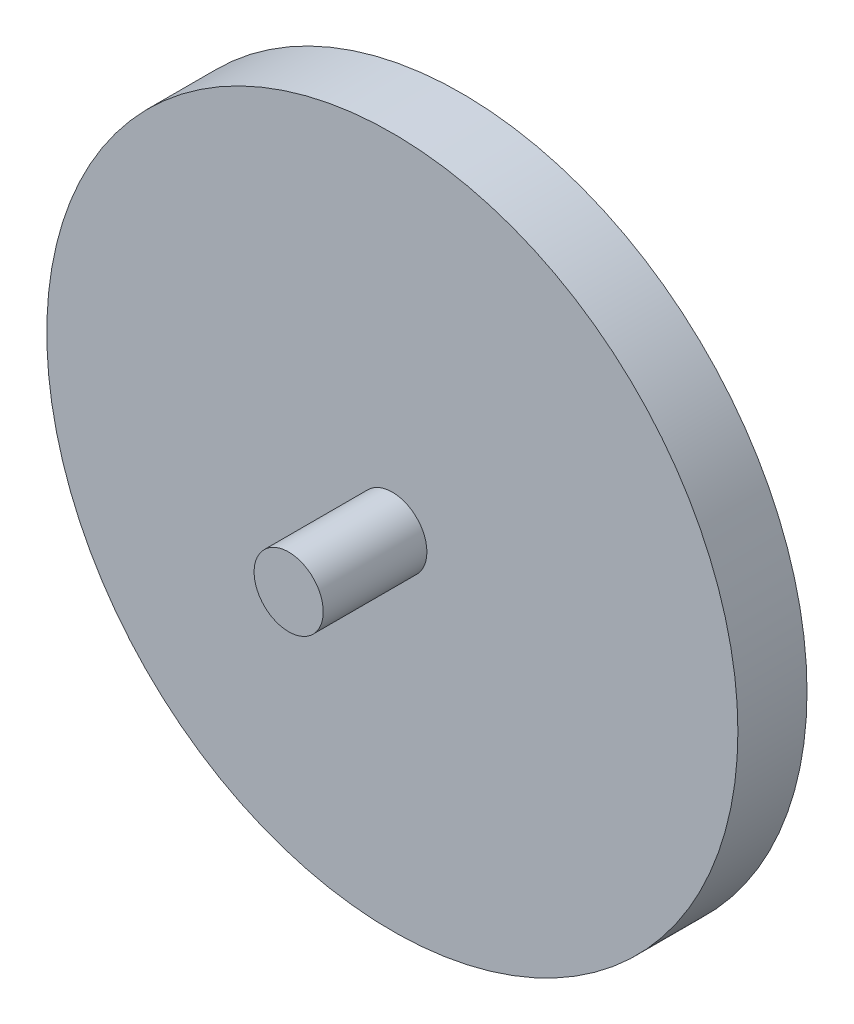
ISO-10303-21;
HEADER;
FILE_DESCRIPTION(('STEP AP214'),'2;1');
FILE_NAME('part.step','',(''),(''),'','','');
FILE_SCHEMA(('AUTOMOTIVE_DESIGN { 1 0 10303 214 1 1 1 1 }'));
ENDSEC;
DATA;
#1=APPLICATION_CONTEXT('core data for automotive mechanical design processes');
#2=APPLICATION_PROTOCOL_DEFINITION('international standard','automotive_design',2000,#1);
#3=PRODUCT_CONTEXT('',#1,'mechanical');
#4=PRODUCT('Part','Part','',(#3));
#5=PRODUCT_RELATED_PRODUCT_CATEGORY('part','',(#4));
#6=PRODUCT_DEFINITION_FORMATION('','',#4);
#7=PRODUCT_DEFINITION_CONTEXT('part definition',#1,'design');
#8=PRODUCT_DEFINITION('design','',#6,#7);
#9=PRODUCT_DEFINITION_SHAPE('','',#8);
#10=(LENGTH_UNIT() NAMED_UNIT(*) SI_UNIT(.MILLI.,.METRE.));
#11=(NAMED_UNIT(*) PLANE_ANGLE_UNIT() SI_UNIT($,.RADIAN.));
#12=(NAMED_UNIT(*) SI_UNIT($,.STERADIAN.) SOLID_ANGLE_UNIT());
#13=UNCERTAINTY_MEASURE_WITH_UNIT(LENGTH_MEASURE(1.E-05),#10,'distance_accuracy_value','');
#14=(GEOMETRIC_REPRESENTATION_CONTEXT(3) GLOBAL_UNCERTAINTY_ASSIGNED_CONTEXT((#13)) GLOBAL_UNIT_ASSIGNED_CONTEXT((#10,
#11,#12)) REPRESENTATION_CONTEXT('',''));
#15=CARTESIAN_POINT('',(0.,0.,0.));
#16=DIRECTION('',(0.,0.,1.));
#17=DIRECTION('',(1.,0.,0.));
#18=AXIS2_PLACEMENT_3D('',#15,#16,#17);
#19=CARTESIAN_POINT('',(-8.0801317233809,13.9642857142857,2.));
#20=DIRECTION('',(0.,0.,-1.));
#21=DIRECTION('',(-1.,0.,0.));
#22=AXIS2_PLACEMENT_3D('',#19,#20,#21);
#23=CYLINDRICAL_SURFACE('',#22,10.);
#24=CARTESIAN_POINT('',(-8.0801317233809,13.9642857142857,2.));
#25=DIRECTION('',(0.,0.,1.));
#26=DIRECTION('',(1.,0.,0.));
#27=AXIS2_PLACEMENT_3D('',#24,#25,#26);
#28=CIRCLE('',#27,10.);
#29=CARTESIAN_POINT('',(1.9198682766191,13.9642857142857,2.));
#30=VERTEX_POINT('',#29);
#31=EDGE_CURVE('E10',#30,#30,#28,.T.);
#32=ORIENTED_EDGE('',*,*,#31,.F.);
#33=EDGE_LOOP('',(#32));
#34=FACE_BOUND('',#33,.T.);
#35=CARTESIAN_POINT('',(-8.0801317233809,13.9642857142857,0.));
#36=DIRECTION('',(0.,0.,1.));
#37=DIRECTION('',(1.,0.,0.));
#38=AXIS2_PLACEMENT_3D('',#35,#36,#37);
#39=CIRCLE('',#38,10.);
#40=CARTESIAN_POINT('',(1.9198682766191,13.9642857142857,0.));
#41=VERTEX_POINT('',#40);
#42=EDGE_CURVE('E34',#41,#41,#39,.T.);
#43=ORIENTED_EDGE('',*,*,#42,.T.);
#44=EDGE_LOOP('',(#43));
#45=FACE_BOUND('',#44,.T.);
#46=ADVANCED_FACE('F31',(#34,#45),#23,.T.);
#47=CARTESIAN_POINT('',(-8.0801317233809,13.9642857142857,2.));
#48=DIRECTION('',(0.,0.,1.));
#49=DIRECTION('',(1.,0.,0.));
#50=AXIS2_PLACEMENT_3D('',#47,#48,#49);
#51=PLANE('',#50);
#52=CARTESIAN_POINT('',(-8.0801317233809,13.9642857142857,2.));
#53=DIRECTION('',(0.,0.,1.));
#54=DIRECTION('',(1.,0.,0.));
#55=AXIS2_PLACEMENT_3D('',#52,#53,#54);
#56=CIRCLE('',#55,1.);
#57=CARTESIAN_POINT('',(-7.0801317233809,13.9642857142857,2.));
#58=VERTEX_POINT('',#57);
#59=EDGE_CURVE('E43',#58,#58,#56,.T.);
#60=ORIENTED_EDGE('',*,*,#59,.F.);
#61=EDGE_LOOP('',(#60));
#62=FACE_BOUND('',#61,.T.);
#63=ORIENTED_EDGE('',*,*,#31,.T.);
#64=EDGE_LOOP('',(#63));
#65=FACE_BOUND('',#64,.T.);
#66=ADVANCED_FACE('F58',(#62,#65),#51,.T.);
#67=CARTESIAN_POINT('',(-8.0801317233809,13.9642857142857,0.));
#68=DIRECTION('',(0.,0.,1.));
#69=DIRECTION('',(1.,0.,0.));
#70=AXIS2_PLACEMENT_3D('',#67,#68,#69);
#71=PLANE('',#70);
#72=ORIENTED_EDGE('',*,*,#42,.F.);
#73=EDGE_LOOP('',(#72));
#74=FACE_BOUND('',#73,.T.);
#75=ADVANCED_FACE('F54',(#74),#71,.F.);
#76=CARTESIAN_POINT('',(-8.0801317233809,13.9642857142857,5.));
#77=DIRECTION('',(0.,0.,-1.));
#78=DIRECTION('',(-1.,0.,0.));
#79=AXIS2_PLACEMENT_3D('',#76,#77,#78);
#80=CYLINDRICAL_SURFACE('',#79,1.);
#81=CARTESIAN_POINT('',(-8.0801317233809,13.9642857142857,5.));
#82=DIRECTION('',(0.,0.,1.));
#83=DIRECTION('',(1.,0.,0.));
#84=AXIS2_PLACEMENT_3D('',#81,#82,#83);
#85=CIRCLE('',#84,1.);
#86=CARTESIAN_POINT('',(-7.0801317233809,13.9642857142857,5.));
#87=VERTEX_POINT('',#86);
#88=EDGE_CURVE('E41',#87,#87,#85,.T.);
#89=ORIENTED_EDGE('',*,*,#88,.F.);
#90=EDGE_LOOP('',(#89));
#91=FACE_BOUND('',#90,.T.);
#92=ORIENTED_EDGE('',*,*,#59,.T.);
#93=EDGE_LOOP('',(#92));
#94=FACE_BOUND('',#93,.T.);
#95=ADVANCED_FACE('F51',(#91,#94),#80,.T.);
#96=CARTESIAN_POINT('',(-8.0801317233809,13.9642857142857,5.));
#97=DIRECTION('',(0.,0.,1.));
#98=DIRECTION('',(1.,0.,0.));
#99=AXIS2_PLACEMENT_3D('',#96,#97,#98);
#100=PLANE('',#99);
#101=ORIENTED_EDGE('',*,*,#88,.T.);
#102=EDGE_LOOP('',(#101));
#103=FACE_BOUND('',#102,.T.);
#104=ADVANCED_FACE('F49',(#103),#100,.T.);
#105=CLOSED_SHELL('',(#46,#66,#75,#95,#104));
#106=MANIFOLD_SOLID_BREP('B2',#105);
#107=ADVANCED_BREP_SHAPE_REPRESENTATION('',(#18,#106),#14);
#108=SHAPE_DEFINITION_REPRESENTATION(#9,#107);
ENDSEC;
END-ISO-10303-21;
